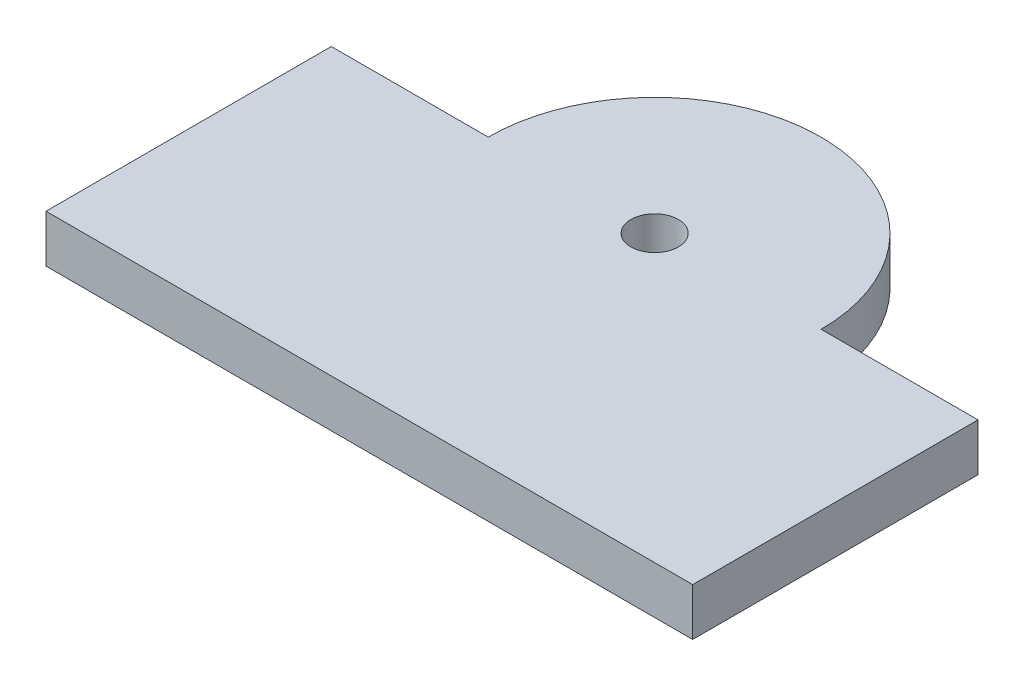
ISO-10303-21;
HEADER;
FILE_DESCRIPTION(('STEP AP214'),'2;1');
FILE_NAME('part.step','',(''),(''),'','','');
FILE_SCHEMA(('AUTOMOTIVE_DESIGN { 1 0 10303 214 1 1 1 1 }'));
ENDSEC;
DATA;
#1=APPLICATION_CONTEXT('core data for automotive mechanical design processes');
#2=APPLICATION_PROTOCOL_DEFINITION('international standard','automotive_design',2000,#1);
#3=PRODUCT_CONTEXT('',#1,'mechanical');
#4=PRODUCT('Part','Part','',(#3));
#5=PRODUCT_RELATED_PRODUCT_CATEGORY('part','',(#4));
#6=PRODUCT_DEFINITION_FORMATION('','',#4);
#7=PRODUCT_DEFINITION_CONTEXT('part definition',#1,'design');
#8=PRODUCT_DEFINITION('design','',#6,#7);
#9=PRODUCT_DEFINITION_SHAPE('','',#8);
#10=(LENGTH_UNIT() NAMED_UNIT(*) SI_UNIT(.MILLI.,.METRE.));
#11=(NAMED_UNIT(*) PLANE_ANGLE_UNIT() SI_UNIT($,.RADIAN.));
#12=(NAMED_UNIT(*) SI_UNIT($,.STERADIAN.) SOLID_ANGLE_UNIT());
#13=UNCERTAINTY_MEASURE_WITH_UNIT(LENGTH_MEASURE(1.E-05),#10,'distance_accuracy_value','');
#14=(GEOMETRIC_REPRESENTATION_CONTEXT(3) GLOBAL_UNCERTAINTY_ASSIGNED_CONTEXT((#13)) GLOBAL_UNIT_ASSIGNED_CONTEXT((#10,
#11,#12)) REPRESENTATION_CONTEXT('',''));
#15=CARTESIAN_POINT('',(0.,0.,0.));
#16=DIRECTION('',(0.,0.,1.));
#17=DIRECTION('',(1.,0.,0.));
#18=AXIS2_PLACEMENT_3D('',#15,#16,#17);
#19=CARTESIAN_POINT('',(-34.,5.,-15.));
#20=DIRECTION('',(0.,0.,1.));
#21=DIRECTION('',(1.,0.,0.));
#22=AXIS2_PLACEMENT_3D('',#19,#20,#21);
#23=PLANE('',#22);
#24=DIRECTION('',(-1.,0.,0.));
#25=VECTOR('',#24,1.);
#26=CARTESIAN_POINT('',(-34.,0.,-15.));
#27=LINE('',#26,#25);
#28=CARTESIAN_POINT('',(34.,0.,-15.));
#29=VERTEX_POINT('',#28);
#30=CARTESIAN_POINT('',(17.5,0.,-15.));
#31=VERTEX_POINT('',#30);
#32=EDGE_CURVE('E102',#29,#31,#27,.T.);
#33=ORIENTED_EDGE('',*,*,#32,.T.);
#34=DIRECTION('',(0.,1.,0.));
#35=VECTOR('',#34,1.);
#36=CARTESIAN_POINT('',(17.5,-49.4974746830583,-15.));
#37=LINE('',#36,#35);
#38=CARTESIAN_POINT('',(17.5,5.,-15.));
#39=VERTEX_POINT('',#38);
#40=EDGE_CURVE('E96',#31,#39,#37,.T.);
#41=ORIENTED_EDGE('',*,*,#40,.T.);
#42=DIRECTION('',(-1.,0.,0.));
#43=VECTOR('',#42,1.);
#44=CARTESIAN_POINT('',(-34.,5.,-15.));
#45=LINE('',#44,#43);
#46=CARTESIAN_POINT('',(34.,5.,-15.));
#47=VERTEX_POINT('',#46);
#48=EDGE_CURVE('E85',#47,#39,#45,.T.);
#49=ORIENTED_EDGE('',*,*,#48,.F.);
#50=DIRECTION('',(0.,-1.,0.));
#51=VECTOR('',#50,1.);
#52=CARTESIAN_POINT('',(34.,5.,-15.));
#53=LINE('',#52,#51);
#54=EDGE_CURVE('E11',#47,#29,#53,.T.);
#55=ORIENTED_EDGE('',*,*,#54,.T.);
#56=EDGE_LOOP('',(#33,#41,#49,#55));
#57=FACE_BOUND('',#56,.T.);
#58=ADVANCED_FACE('F33',(#57),#23,.F.);
#59=CARTESIAN_POINT('',(34.,5.,15.));
#60=DIRECTION('',(-1.,0.,0.));
#61=DIRECTION('',(0.,0.,1.));
#62=AXIS2_PLACEMENT_3D('',#59,#60,#61);
#63=PLANE('',#62);
#64=DIRECTION('',(0.,0.,-1.));
#65=VECTOR('',#64,1.);
#66=CARTESIAN_POINT('',(34.,0.,15.));
#67=LINE('',#66,#65);
#68=CARTESIAN_POINT('',(34.,0.,15.));
#69=VERTEX_POINT('',#68);
#70=EDGE_CURVE('E103',#69,#29,#67,.T.);
#71=ORIENTED_EDGE('',*,*,#70,.T.);
#72=ORIENTED_EDGE('',*,*,#54,.F.);
#73=DIRECTION('',(0.,0.,-1.));
#74=VECTOR('',#73,1.);
#75=CARTESIAN_POINT('',(34.,5.,15.));
#76=LINE('',#75,#74);
#77=CARTESIAN_POINT('',(34.,5.,15.));
#78=VERTEX_POINT('',#77);
#79=EDGE_CURVE('E107',#78,#47,#76,.T.);
#80=ORIENTED_EDGE('',*,*,#79,.F.);
#81=DIRECTION('',(0.,-1.,0.));
#82=VECTOR('',#81,1.);
#83=CARTESIAN_POINT('',(34.,5.,15.));
#84=LINE('',#83,#82);
#85=EDGE_CURVE('E116',#78,#69,#84,.T.);
#86=ORIENTED_EDGE('',*,*,#85,.T.);
#87=EDGE_LOOP('',(#71,#72,#80,#86));
#88=FACE_BOUND('',#87,.T.);
#89=ADVANCED_FACE('F35',(#88),#63,.F.);
#90=CARTESIAN_POINT('',(-17.5,5.,-15.));
#91=VERTEX_POINT('',#90);
#92=CARTESIAN_POINT('',(-34.,5.,-15.));
#93=VERTEX_POINT('',#92);
#94=EDGE_CURVE('E110',#91,#93,#45,.T.);
#95=ORIENTED_EDGE('',*,*,#94,.F.);
#96=DIRECTION('',(0.,1.,0.));
#97=VECTOR('',#96,1.);
#98=CARTESIAN_POINT('',(-17.5,-49.4974746830583,-15.));
#99=LINE('',#98,#97);
#100=CARTESIAN_POINT('',(-17.5,0.,-15.));
#101=VERTEX_POINT('',#100);
#102=EDGE_CURVE('E97',#91,#101,#99,.F.);
#103=ORIENTED_EDGE('',*,*,#102,.T.);
#104=CARTESIAN_POINT('',(-34.,0.,-15.));
#105=VERTEX_POINT('',#104);
#106=EDGE_CURVE('E119',#101,#105,#27,.T.);
#107=ORIENTED_EDGE('',*,*,#106,.T.);
#108=DIRECTION('',(0.,-1.,0.));
#109=VECTOR('',#108,1.);
#110=CARTESIAN_POINT('',(-34.,5.,-15.));
#111=LINE('',#110,#109);
#112=EDGE_CURVE('E41',#93,#105,#111,.T.);
#113=ORIENTED_EDGE('',*,*,#112,.F.);
#114=EDGE_LOOP('',(#95,#103,#107,#113));
#115=FACE_BOUND('',#114,.T.);
#116=ADVANCED_FACE('F148',(#115),#23,.F.);
#117=CARTESIAN_POINT('',(-34.,5.,15.));
#118=DIRECTION('',(1.,0.,0.));
#119=DIRECTION('',(0.,0.,-1.));
#120=AXIS2_PLACEMENT_3D('',#117,#118,#119);
#121=PLANE('',#120);
#122=DIRECTION('',(0.,0.,1.));
#123=VECTOR('',#122,1.);
#124=CARTESIAN_POINT('',(-34.,0.,15.));
#125=LINE('',#124,#123);
#126=CARTESIAN_POINT('',(-34.,0.,15.));
#127=VERTEX_POINT('',#126);
#128=EDGE_CURVE('E121',#105,#127,#125,.T.);
#129=ORIENTED_EDGE('',*,*,#128,.T.);
#130=DIRECTION('',(0.,-1.,0.));
#131=VECTOR('',#130,1.);
#132=CARTESIAN_POINT('',(-34.,5.,15.));
#133=LINE('',#132,#131);
#134=CARTESIAN_POINT('',(-34.,5.,15.));
#135=VERTEX_POINT('',#134);
#136=EDGE_CURVE('E125',#135,#127,#133,.T.);
#137=ORIENTED_EDGE('',*,*,#136,.F.);
#138=DIRECTION('',(0.,0.,1.));
#139=VECTOR('',#138,1.);
#140=CARTESIAN_POINT('',(-34.,5.,15.));
#141=LINE('',#140,#139);
#142=EDGE_CURVE('E109',#93,#135,#141,.T.);
#143=ORIENTED_EDGE('',*,*,#142,.F.);
#144=ORIENTED_EDGE('',*,*,#112,.T.);
#145=EDGE_LOOP('',(#129,#137,#143,#144));
#146=FACE_BOUND('',#145,.T.);
#147=ADVANCED_FACE('F131',(#146),#121,.F.);
#148=CARTESIAN_POINT('',(-34.,5.,15.));
#149=DIRECTION('',(0.,0.,-1.));
#150=DIRECTION('',(-1.,0.,0.));
#151=AXIS2_PLACEMENT_3D('',#148,#149,#150);
#152=PLANE('',#151);
#153=DIRECTION('',(1.,0.,0.));
#154=VECTOR('',#153,1.);
#155=CARTESIAN_POINT('',(-34.,0.,15.));
#156=LINE('',#155,#154);
#157=EDGE_CURVE('E78',#127,#69,#156,.T.);
#158=ORIENTED_EDGE('',*,*,#157,.T.);
#159=ORIENTED_EDGE('',*,*,#85,.F.);
#160=DIRECTION('',(1.,0.,0.));
#161=VECTOR('',#160,1.);
#162=CARTESIAN_POINT('',(-34.,5.,15.));
#163=LINE('',#162,#161);
#164=EDGE_CURVE('E57',#135,#78,#163,.T.);
#165=ORIENTED_EDGE('',*,*,#164,.F.);
#166=ORIENTED_EDGE('',*,*,#136,.T.);
#167=EDGE_LOOP('',(#158,#159,#165,#166));
#168=FACE_BOUND('',#167,.T.);
#169=ADVANCED_FACE('F139',(#168),#152,.F.);
#170=CARTESIAN_POINT('',(0.,5.,0.));
#171=DIRECTION('',(0.,-1.,0.));
#172=DIRECTION('',(0.,0.,-1.));
#173=AXIS2_PLACEMENT_3D('',#170,#171,#172);
#174=PLANE('',#173);
#175=CARTESIAN_POINT('',(0.,5.,-15.));
#176=DIRECTION('',(0.,-1.,0.));
#177=DIRECTION('',(0.,0.,-1.));
#178=AXIS2_PLACEMENT_3D('',#175,#176,#177);
#179=CIRCLE('',#178,2.5);
#180=CARTESIAN_POINT('',(0.,5.,-17.5));
#181=VERTEX_POINT('',#180);
#182=EDGE_CURVE('E99',#181,#181,#179,.T.);
#183=ORIENTED_EDGE('',*,*,#182,.T.);
#184=EDGE_LOOP('',(#183));
#185=FACE_BOUND('',#184,.T.);
#186=ORIENTED_EDGE('',*,*,#48,.T.);
#187=CARTESIAN_POINT('',(0.,5.,-15.));
#188=DIRECTION('',(0.,1.,0.));
#189=DIRECTION('',(0.,0.,1.));
#190=AXIS2_PLACEMENT_3D('',#187,#188,#189);
#191=CIRCLE('',#190,17.5);
#192=EDGE_CURVE('E94',#39,#91,#191,.T.);
#193=ORIENTED_EDGE('',*,*,#192,.T.);
#194=ORIENTED_EDGE('',*,*,#94,.T.);
#195=ORIENTED_EDGE('',*,*,#142,.T.);
#196=ORIENTED_EDGE('',*,*,#164,.T.);
#197=ORIENTED_EDGE('',*,*,#79,.T.);
#198=EDGE_LOOP('',(#186,#193,#194,#195,#196,#197));
#199=FACE_BOUND('',#198,.T.);
#200=ADVANCED_FACE('F105',(#185,#199),#174,.F.);
#201=CARTESIAN_POINT('',(0.,0.,0.));
#202=DIRECTION('',(0.,-1.,0.));
#203=DIRECTION('',(0.,0.,-1.));
#204=AXIS2_PLACEMENT_3D('',#201,#202,#203);
#205=PLANE('',#204);
#206=CARTESIAN_POINT('',(0.,0.,-15.));
#207=DIRECTION('',(0.,1.,0.));
#208=DIRECTION('',(0.,0.,1.));
#209=AXIS2_PLACEMENT_3D('',#206,#207,#208);
#210=CIRCLE('',#209,2.5);
#211=CARTESIAN_POINT('',(0.,0.,-12.5));
#212=VERTEX_POINT('',#211);
#213=EDGE_CURVE('E163',#212,#212,#210,.T.);
#214=ORIENTED_EDGE('',*,*,#213,.T.);
#215=EDGE_LOOP('',(#214));
#216=FACE_BOUND('',#215,.T.);
#217=ORIENTED_EDGE('',*,*,#106,.F.);
#218=CARTESIAN_POINT('',(0.,0.,-15.));
#219=DIRECTION('',(0.,-1.,0.));
#220=DIRECTION('',(0.,0.,-1.));
#221=AXIS2_PLACEMENT_3D('',#218,#219,#220);
#222=CIRCLE('',#221,17.5);
#223=EDGE_CURVE('E48',#31,#101,#222,.F.);
#224=ORIENTED_EDGE('',*,*,#223,.F.);
#225=ORIENTED_EDGE('',*,*,#32,.F.);
#226=ORIENTED_EDGE('',*,*,#70,.F.);
#227=ORIENTED_EDGE('',*,*,#157,.F.);
#228=ORIENTED_EDGE('',*,*,#128,.F.);
#229=EDGE_LOOP('',(#217,#224,#225,#226,#227,#228));
#230=FACE_BOUND('',#229,.T.);
#231=ADVANCED_FACE('F136',(#216,#230),#205,.T.);
#232=CARTESIAN_POINT('',(0.,-49.4974746830583,-15.));
#233=DIRECTION('',(0.,1.,0.));
#234=DIRECTION('',(0.,0.,1.));
#235=AXIS2_PLACEMENT_3D('',#232,#233,#234);
#236=CYLINDRICAL_SURFACE('',#235,17.5);
#237=ORIENTED_EDGE('',*,*,#40,.F.);
#238=ORIENTED_EDGE('',*,*,#223,.T.);
#239=ORIENTED_EDGE('',*,*,#102,.F.);
#240=ORIENTED_EDGE('',*,*,#192,.F.);
#241=EDGE_LOOP('',(#237,#238,#239,#240));
#242=FACE_BOUND('',#241,.T.);
#243=ADVANCED_FACE('F95',(#242),#236,.T.);
#244=CARTESIAN_POINT('',(0.,0.,-15.));
#245=DIRECTION('',(0.,1.,0.));
#246=DIRECTION('',(0.,0.,1.));
#247=AXIS2_PLACEMENT_3D('',#244,#245,#246);
#248=CYLINDRICAL_SURFACE('',#247,2.5);
#249=ORIENTED_EDGE('',*,*,#213,.F.);
#250=EDGE_LOOP('',(#249));
#251=FACE_BOUND('',#250,.T.);
#252=ORIENTED_EDGE('',*,*,#182,.F.);
#253=EDGE_LOOP('',(#252));
#254=FACE_BOUND('',#253,.T.);
#255=ADVANCED_FACE('F168',(#251,#254),#248,.F.);
#256=CLOSED_SHELL('',(#58,#89,#116,#147,#169,#200,#231,#243,#255));
#257=MANIFOLD_SOLID_BREP('B2',#256);
#258=ADVANCED_BREP_SHAPE_REPRESENTATION('',(#18,#257),#14);
#259=SHAPE_DEFINITION_REPRESENTATION(#9,#258);
ENDSEC;
END-ISO-10303-21;
